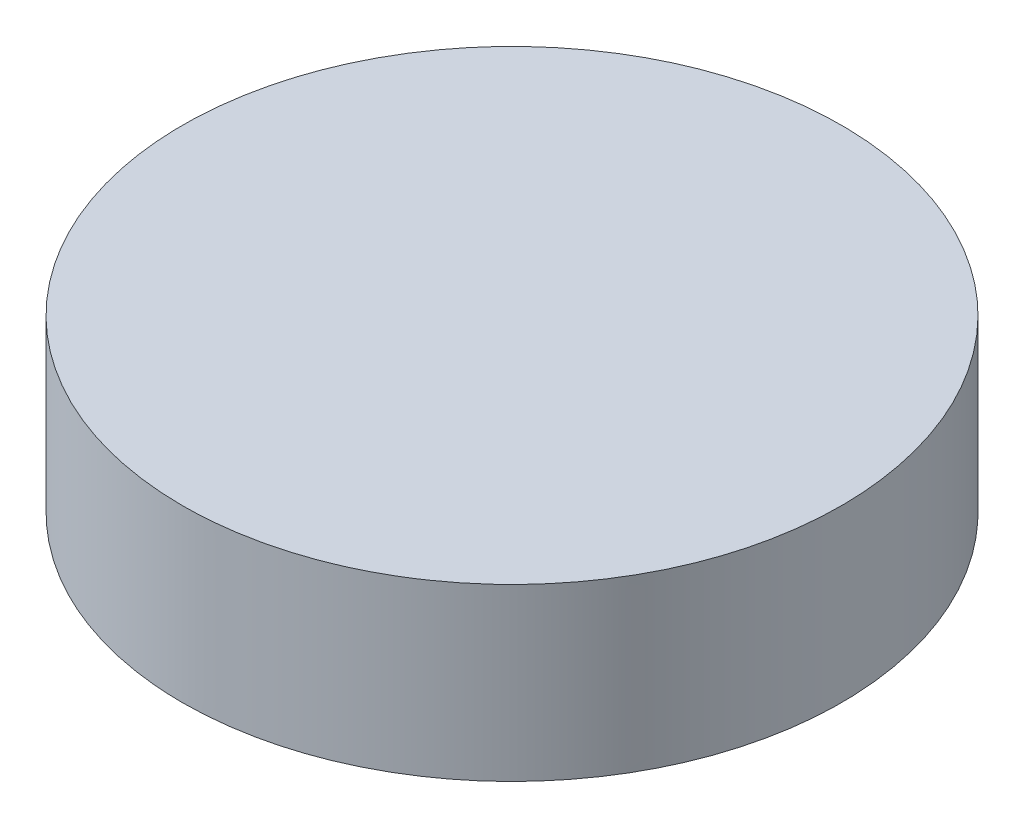
ISO-10303-21;
HEADER;
FILE_DESCRIPTION(('STEP AP214'),'2;1');
FILE_NAME('part.step','',(''),(''),'','','');
FILE_SCHEMA(('AUTOMOTIVE_DESIGN { 1 0 10303 214 1 1 1 1 }'));
ENDSEC;
DATA;
#1=APPLICATION_CONTEXT('core data for automotive mechanical design processes');
#2=APPLICATION_PROTOCOL_DEFINITION('international standard','automotive_design',2000,#1);
#3=PRODUCT_CONTEXT('',#1,'mechanical');
#4=PRODUCT('Part','Part','',(#3));
#5=PRODUCT_RELATED_PRODUCT_CATEGORY('part','',(#4));
#6=PRODUCT_DEFINITION_FORMATION('','',#4);
#7=PRODUCT_DEFINITION_CONTEXT('part definition',#1,'design');
#8=PRODUCT_DEFINITION('design','',#6,#7);
#9=PRODUCT_DEFINITION_SHAPE('','',#8);
#10=(LENGTH_UNIT() NAMED_UNIT(*) SI_UNIT(.MILLI.,.METRE.));
#11=(NAMED_UNIT(*) PLANE_ANGLE_UNIT() SI_UNIT($,.RADIAN.));
#12=(NAMED_UNIT(*) SI_UNIT($,.STERADIAN.) SOLID_ANGLE_UNIT());
#13=UNCERTAINTY_MEASURE_WITH_UNIT(LENGTH_MEASURE(1.E-05),#10,'distance_accuracy_value','');
#14=(GEOMETRIC_REPRESENTATION_CONTEXT(3) GLOBAL_UNCERTAINTY_ASSIGNED_CONTEXT((#13)) GLOBAL_UNIT_ASSIGNED_CONTEXT((#10,
#11,#12)) REPRESENTATION_CONTEXT('',''));
#15=CARTESIAN_POINT('',(0.,0.,0.));
#16=DIRECTION('',(0.,0.,1.));
#17=DIRECTION('',(1.,0.,0.));
#18=AXIS2_PLACEMENT_3D('',#15,#16,#17);
#19=CARTESIAN_POINT('',(-12.5,-11.0166312331574,1.28535533905933));
#20=CARTESIAN_POINT('',(-12.3317700207924,-11.0166312331574,1.28535533905933));
#21=CARTESIAN_POINT('',(-11.9953100623771,-11.0166312331574,1.21842929220248));
#22=CARTESIAN_POINT('',(-11.5674545927316,-11.0166312331574,0.932545407268426));
#23=CARTESIAN_POINT('',(-11.2815707077975,-11.0166312331574,0.504689937622919));
#24=CARTESIAN_POINT('',(-11.1811816375122,-11.0166312331574,0.));
#25=CARTESIAN_POINT('',(-11.2815707077975,-11.0166312331574,-0.504689937622919));
#26=CARTESIAN_POINT('',(-11.5674545927316,-11.0166312331574,-0.932545407268426));
#27=CARTESIAN_POINT('',(-11.9953100623771,-11.0166312331574,-1.21842929220248));
#28=CARTESIAN_POINT('',(-12.5,-11.0166312331574,-1.31881836248775));
#29=CARTESIAN_POINT('',(-13.0046899376229,-11.0166312331574,-1.21842929220248));
#30=CARTESIAN_POINT('',(-13.4325454072684,-11.0166312331574,-0.932545407268426));
#31=CARTESIAN_POINT('',(-13.7184292922025,-11.0166312331574,-0.50468993762292));
#32=CARTESIAN_POINT('',(-13.8188183624877,-11.0166312331574,0.));
#33=CARTESIAN_POINT('',(-13.7184292922025,-11.0166312331574,0.504689937622919));
#34=CARTESIAN_POINT('',(-13.4325454072684,-11.0166312331574,0.932545407268426));
#35=CARTESIAN_POINT('',(-13.0046899376229,-11.0166312331574,1.21842929220248));
#36=CARTESIAN_POINT('',(-12.6682299792076,-11.0166312331574,1.28535533905933));
#37=CARTESIAN_POINT('',(-12.5,-11.0166312331574,1.28535533905933));
#38=B_SPLINE_CURVE_WITH_KNOTS('',3,(#19,#20,#21,#22,#23,#24,#25,#26,#27,#28,#29,#30,#31,#32,#33,
#34,#35,#36,#37),.UNSPECIFIED.,.T.,.F.,(4,1,1,1,1,1,1,1,1,1,1,1,1,1,1,1,4),(0.,
0.0625000000000001,0.125,0.1875,0.25,0.3125,0.375,0.4375,0.5,0.5625,0.625,0.6875,0.75,0.8125,
0.875,0.9375,1.),.UNSPECIFIED.);
#39=DIRECTION('',(0.,1.,0.));
#40=VECTOR('',#39,1.);
#41=SURFACE_OF_LINEAR_EXTRUSION('',#38,#40);
#42=CARTESIAN_POINT('',(-12.5,-11.0166312331574,1.28535533905933));
#43=CARTESIAN_POINT('',(-12.3317700207924,-11.0166312331574,1.28535533905933));
#44=CARTESIAN_POINT('',(-11.9953100623771,-11.0166312331574,1.21842929220248));
#45=CARTESIAN_POINT('',(-11.5674545927316,-11.0166312331574,0.932545407268426));
#46=CARTESIAN_POINT('',(-11.2815707077975,-11.0166312331574,0.504689937622919));
#47=CARTESIAN_POINT('',(-11.1811816375122,-11.0166312331574,0.));
#48=CARTESIAN_POINT('',(-11.2815707077975,-11.0166312331574,-0.504689937622919));
#49=CARTESIAN_POINT('',(-11.5674545927316,-11.0166312331574,-0.932545407268426));
#50=CARTESIAN_POINT('',(-11.9953100623771,-11.0166312331574,-1.21842929220248));
#51=CARTESIAN_POINT('',(-12.5,-11.0166312331574,-1.31881836248775));
#52=CARTESIAN_POINT('',(-13.0046899376229,-11.0166312331574,-1.21842929220248));
#53=CARTESIAN_POINT('',(-13.4325454072684,-11.0166312331574,-0.932545407268426));
#54=CARTESIAN_POINT('',(-13.7184292922025,-11.0166312331574,-0.50468993762292));
#55=CARTESIAN_POINT('',(-13.8188183624877,-11.0166312331574,0.));
#56=CARTESIAN_POINT('',(-13.7184292922025,-11.0166312331574,0.504689937622919));
#57=CARTESIAN_POINT('',(-13.4325454072684,-11.0166312331574,0.932545407268426));
#58=CARTESIAN_POINT('',(-13.0046899376229,-11.0166312331574,1.21842929220248));
#59=CARTESIAN_POINT('',(-12.6682299792076,-11.0166312331574,1.28535533905933));
#60=CARTESIAN_POINT('',(-12.5,-11.0166312331574,1.28535533905933));
#61=B_SPLINE_CURVE_WITH_KNOTS('',3,(#42,#43,#44,#45,#46,#47,#48,#49,#50,#51,#52,#53,#54,#55,#56,
#57,#58,#59,#60),.UNSPECIFIED.,.T.,.F.,(4,1,1,1,1,1,1,1,1,1,1,1,1,1,1,1,4),(0.,
0.0625000000000001,0.125,0.1875,0.25,0.3125,0.375,0.4375,0.5,0.5625,0.625,0.6875,0.75,0.8125,
0.875,0.9375,1.),.UNSPECIFIED.);
#62=CARTESIAN_POINT('',(-12.5,-11.0166312331574,1.28535533905933));
#63=VERTEX_POINT('',#62);
#64=EDGE_CURVE('E9',#63,#63,#61,.T.);
#65=ORIENTED_EDGE('',*,*,#64,.T.);
#66=EDGE_LOOP('',(#65));
#67=FACE_BOUND('',#66,.T.);
#68=CARTESIAN_POINT('',(-12.5,-10.351,1.28535533905933));
#69=CARTESIAN_POINT('',(-12.5210292435893,-10.351,1.28535535428354));
#70=CARTESIAN_POINT('',(-12.5420580506909,-10.351,1.2848324564651));
#71=CARTESIAN_POINT('',(-12.5840656469514,-10.351,1.28275095206051));
#72=CARTESIAN_POINT('',(-12.605044433095,-10.351,1.28119228454248));
#73=CARTESIAN_POINT('',(-12.6469017924796,-10.351,1.27704921828212));
#74=CARTESIAN_POINT('',(-12.6677803587443,-10.351,1.2744647491513));
#75=CARTESIAN_POINT('',(-12.7093873858979,-10.351,1.26828002178174));
#76=CARTESIAN_POINT('',(-12.7301158402734,-10.351,1.26467971973334));
#77=CARTESIAN_POINT('',(-12.7713726611837,-10.351,1.25647322848943));
#78=CARTESIAN_POINT('',(-12.7919010277185,-10.351,1.25186703929392));
#79=CARTESIAN_POINT('',(-12.832707709252,-10.351,1.24165865806837));
#80=CARTESIAN_POINT('',(-12.8529860349978,-10.351,1.23605650900607));
#81=CARTESIAN_POINT('',(-12.8932426430212,-10.351,1.22386610104828));
#82=CARTESIAN_POINT('',(-12.9132209457939,-10.351,1.21727790985115));
#83=CARTESIAN_POINT('',(-12.9528275830444,-10.351,1.20312529881931));
#84=CARTESIAN_POINT('',(-12.9724559380415,-10.351,1.19556093643833));
#85=CARTESIAN_POINT('',(-13.0113124478785,-10.351,1.17946604308371));
#86=CARTESIAN_POINT('',(-13.0305406027184,-10.351,1.17093551211008));
#87=CARTESIAN_POINT('',(-13.06855413176,-10.351,1.15293679752466));
#88=CARTESIAN_POINT('',(-13.0873394798451,-10.351,1.14346855877762));
#89=CARTESIAN_POINT('',(-13.1244251203754,-10.351,1.12362275852903));
#90=CARTESIAN_POINT('',(-13.1427253794428,-10.351,1.11324513466535));
#91=CARTESIAN_POINT('',(-13.1787984767248,-10.351,1.09160886850265));
#92=CARTESIAN_POINT('',(-13.1965712921558,-10.351,1.08035018822159));
#93=CARTESIAN_POINT('',(-13.2315471338735,-10.351,1.05698007794264));
#94=CARTESIAN_POINT('',(-13.2487501601601,-10.351,1.04486864794475));
#95=CARTESIAN_POINT('',(-13.2825440403118,-10.351,1.0198212922901));
#96=CARTESIAN_POINT('',(-13.2991349205488,-10.351,1.00688540221767));
#97=CARTESIAN_POINT('',(-13.331662109414,-10.351,0.980217396939715));
#98=CARTESIAN_POINT('',(-13.3475984628843,-10.351,0.966485336436221));
#99=CARTESIAN_POINT('',(-13.3787742546724,-10.351,0.938253224868504));
#100=CARTESIAN_POINT('',(-13.3940137339342,-10.351,0.923753219032213));
#101=CARTESIAN_POINT('',(-13.4237532190322,-10.351,0.894013733934155));
#102=CARTESIAN_POINT('',(-13.4382532248685,-10.351,0.878774254672389));
#103=CARTESIAN_POINT('',(-13.4664853364362,-10.351,0.847598462884291));
#104=CARTESIAN_POINT('',(-13.4802173969397,-10.351,0.831662109414029));
#105=CARTESIAN_POINT('',(-13.5068854022177,-10.351,0.799134920548772));
#106=CARTESIAN_POINT('',(-13.5198212922901,-10.351,0.782544040311809));
#107=CARTESIAN_POINT('',(-13.5448686479447,-10.351,0.748750160160128));
#108=CARTESIAN_POINT('',(-13.5569800779426,-10.351,0.731547133873459));
#109=CARTESIAN_POINT('',(-13.5803501882216,-10.351,0.696571292155848));
#110=CARTESIAN_POINT('',(-13.5916088685027,-10.351,0.678798476724906));
#111=CARTESIAN_POINT('',(-13.6132451346653,-10.351,0.642725379442669));
#112=CARTESIAN_POINT('',(-13.623622758529,-10.351,0.624425120374889));
#113=CARTESIAN_POINT('',(-13.6434685587776,-10.351,0.587339479845542));
#114=CARTESIAN_POINT('',(-13.6529367975248,-10.351,0.568554131761774));
#115=CARTESIAN_POINT('',(-13.67093551211,-10.351,0.530540602716617));
#116=CARTESIAN_POINT('',(-13.6794660430833,-10.351,0.511312447871825));
#117=CARTESIAN_POINT('',(-13.6955609364387,-10.351,0.472455938048209));
#118=CARTESIAN_POINT('',(-13.7031252988208,-10.351,0.452827583069387));
#119=CARTESIAN_POINT('',(-13.7172779098496,-10.351,0.413220945768882));
#120=CARTESIAN_POINT('',(-13.7238661010426,-10.351,0.39324264292792));
#121=CARTESIAN_POINT('',(-13.7360565090117,-10.351,0.352986035091083));
#122=CARTESIAN_POINT('',(-13.7416586580894,-10.351,0.332707709600189));
#123=CARTESIAN_POINT('',(-13.7518670392729,-10.351,0.291901027370323));
#124=CARTESIAN_POINT('',(-13.7564732284109,-10.351,0.271372659884375));
#125=CARTESIAN_POINT('',(-13.7646797198118,-10.351,0.230115841572818));
#126=CARTESIAN_POINT('',(-13.7682800220747,-10.351,0.209387390747211));
#127=CARTESIAN_POINT('',(-13.7744647488584,-10.351,0.167780353895161));
#128=CARTESIAN_POINT('',(-13.7770492171889,-10.351,0.146901774382847));
#129=CARTESIAN_POINT('',(-13.7811922856357,-10.351,0.10504445119053));
#130=CARTESIAN_POINT('',(-13.7827509561402,-10.351,0.0840657144826372));
#131=CARTESIAN_POINT('',(-13.7848324523857,-10.351,0.0420579831636655));
#132=CARTESIAN_POINT('',(-13.7853553390593,-10.351,0.0210289915818326));
#133=CARTESIAN_POINT('',(-13.7853553390593,-10.351,-0.0210289915818331));
#134=CARTESIAN_POINT('',(-13.7848324523857,-10.351,-0.0420579831636659));
#135=CARTESIAN_POINT('',(-13.7827509561402,-10.351,-0.0840657144826377));
#136=CARTESIAN_POINT('',(-13.7811922856357,-10.351,-0.10504445119053));
#137=CARTESIAN_POINT('',(-13.7770492171889,-10.351,-0.146901774382848));
#138=CARTESIAN_POINT('',(-13.7744647488584,-10.351,-0.167780353895162));
#139=CARTESIAN_POINT('',(-13.7682800220747,-10.351,-0.209387390747211));
#140=CARTESIAN_POINT('',(-13.7646797198118,-10.351,-0.230115841572819));
#141=CARTESIAN_POINT('',(-13.7564732284109,-10.351,-0.271372659884376));
#142=CARTESIAN_POINT('',(-13.7518670392729,-10.351,-0.291901027370324));
#143=CARTESIAN_POINT('',(-13.7416586580894,-10.351,-0.33270770960019));
#144=CARTESIAN_POINT('',(-13.7360565090117,-10.351,-0.352986035091084));
#145=CARTESIAN_POINT('',(-13.7238661010426,-10.351,-0.393242642927921));
#146=CARTESIAN_POINT('',(-13.7172779098496,-10.351,-0.413220945768883));
#147=CARTESIAN_POINT('',(-13.7031252988208,-10.351,-0.452827583069388));
#148=CARTESIAN_POINT('',(-13.6955609364387,-10.351,-0.472455938048211));
#149=CARTESIAN_POINT('',(-13.6794660430833,-10.351,-0.511312447871826));
#150=CARTESIAN_POINT('',(-13.67093551211,-10.351,-0.530540602716618));
#151=CARTESIAN_POINT('',(-13.6529367975248,-10.351,-0.568554131761775));
#152=CARTESIAN_POINT('',(-13.6434685587776,-10.351,-0.587339479845544));
#153=CARTESIAN_POINT('',(-13.623622758529,-10.351,-0.624425120374891));
#154=CARTESIAN_POINT('',(-13.6132451346653,-10.351,-0.64272537944267));
#155=CARTESIAN_POINT('',(-13.5916088685027,-10.351,-0.678798476724906));
#156=CARTESIAN_POINT('',(-13.5803501882216,-10.351,-0.69657129215585));
#157=CARTESIAN_POINT('',(-13.5569800779426,-10.351,-0.731547133873461));
#158=CARTESIAN_POINT('',(-13.5448686479447,-10.351,-0.748750160160129));
#159=CARTESIAN_POINT('',(-13.5198212922901,-10.351,-0.78254404031181));
#160=CARTESIAN_POINT('',(-13.5068854022177,-10.351,-0.799134920548773));
#161=CARTESIAN_POINT('',(-13.4802173969397,-10.351,-0.83166210941403));
#162=CARTESIAN_POINT('',(-13.4664853364362,-10.351,-0.847598462884291));
#163=CARTESIAN_POINT('',(-13.4382532248685,-10.351,-0.87877425467239));
#164=CARTESIAN_POINT('',(-13.4237532190322,-10.351,-0.894013733934156));
#165=CARTESIAN_POINT('',(-13.3940137339342,-10.351,-0.923753219032213));
#166=CARTESIAN_POINT('',(-13.3787742546724,-10.351,-0.938253224868505));
#167=CARTESIAN_POINT('',(-13.3475984628843,-10.351,-0.966485336436221));
#168=CARTESIAN_POINT('',(-13.331662109414,-10.351,-0.980217396939716));
#169=CARTESIAN_POINT('',(-13.2991349205488,-10.351,-1.00688540221767));
#170=CARTESIAN_POINT('',(-13.2825440403118,-10.351,-1.0198212922901));
#171=CARTESIAN_POINT('',(-13.2487501601601,-10.351,-1.04486864794475));
#172=CARTESIAN_POINT('',(-13.2315471338735,-10.351,-1.05698007794264));
#173=CARTESIAN_POINT('',(-13.1965712921558,-10.351,-1.08035018822159));
#174=CARTESIAN_POINT('',(-13.1787984767249,-10.351,-1.09160886850266));
#175=CARTESIAN_POINT('',(-13.1427253794427,-10.351,-1.11324513466535));
#176=CARTESIAN_POINT('',(-13.1244251203749,-10.351,-1.12362275852901));
#177=CARTESIAN_POINT('',(-13.0873394798455,-10.351,-1.14346855877765));
#178=CARTESIAN_POINT('',(-13.0685541317618,-10.351,-1.15293679752477));
#179=CARTESIAN_POINT('',(-13.0305406027166,-10.351,-1.17093551210997));
#180=CARTESIAN_POINT('',(-13.0113124478718,-10.351,-1.17946604308331));
#181=CARTESIAN_POINT('',(-12.9724559380482,-10.351,-1.19556093643873));
#182=CARTESIAN_POINT('',(-12.9528275830694,-10.351,-1.20312529882082));
#183=CARTESIAN_POINT('',(-12.9132209457689,-10.351,-1.21727790984964));
#184=CARTESIAN_POINT('',(-12.8932426429279,-10.351,-1.22386610104265));
#185=CARTESIAN_POINT('',(-12.8529860350911,-10.351,-1.23605650901171));
#186=CARTESIAN_POINT('',(-12.8327077096002,-10.351,-1.24165865808941));
#187=CARTESIAN_POINT('',(-12.7919010273703,-10.351,-1.25186703927288));
#188=CARTESIAN_POINT('',(-12.7713726598844,-10.351,-1.25647322841093));
#189=CARTESIAN_POINT('',(-12.7301158415728,-10.351,-1.26467971981183));
#190=CARTESIAN_POINT('',(-12.7093873907472,-10.351,-1.26828002207469));
#191=CARTESIAN_POINT('',(-12.6677803538952,-10.351,-1.27446474885836));
#192=CARTESIAN_POINT('',(-12.6469017743828,-10.351,-1.27704921718887));
#193=CARTESIAN_POINT('',(-12.6050444511905,-10.351,-1.28119228563567));
#194=CARTESIAN_POINT('',(-12.5840657144826,-10.351,-1.28275095614019));
#195=CARTESIAN_POINT('',(-12.5420579831637,-10.351,-1.28483245238567));
#196=CARTESIAN_POINT('',(-12.5210289915818,-10.351,-1.28535533905933));
#197=CARTESIAN_POINT('',(-12.4789710084182,-10.351,-1.28535533905933));
#198=CARTESIAN_POINT('',(-12.4579420168363,-10.351,-1.28483245238567));
#199=CARTESIAN_POINT('',(-12.4159342855174,-10.351,-1.28275095614019));
#200=CARTESIAN_POINT('',(-12.3949555488095,-10.351,-1.28119228563567));
#201=CARTESIAN_POINT('',(-12.3530982256172,-10.351,-1.27704921718887));
#202=CARTESIAN_POINT('',(-12.3322196461048,-10.351,-1.27446474885836));
#203=CARTESIAN_POINT('',(-12.2906126092528,-10.351,-1.26828002207469));
#204=CARTESIAN_POINT('',(-12.2698841584272,-10.351,-1.26467971981183));
#205=CARTESIAN_POINT('',(-12.2286273401156,-10.351,-1.25647322841093));
#206=CARTESIAN_POINT('',(-12.2080989726297,-10.351,-1.25186703927288));
#207=CARTESIAN_POINT('',(-12.1672922903998,-10.351,-1.24165865808941));
#208=CARTESIAN_POINT('',(-12.1470139649089,-10.351,-1.23605650901171));
#209=CARTESIAN_POINT('',(-12.1067573570721,-10.351,-1.22386610104265));
#210=CARTESIAN_POINT('',(-12.0867790542311,-10.351,-1.21727790984964));
#211=CARTESIAN_POINT('',(-12.0471724169306,-10.351,-1.20312529882082));
#212=CARTESIAN_POINT('',(-12.0275440619518,-10.351,-1.19556093643873));
#213=CARTESIAN_POINT('',(-11.9886875521282,-10.351,-1.17946604308331));
#214=CARTESIAN_POINT('',(-11.9694593972834,-10.351,-1.17093551210997));
#215=CARTESIAN_POINT('',(-11.9314458682382,-10.351,-1.15293679752477));
#216=CARTESIAN_POINT('',(-11.9126605201545,-10.351,-1.14346855877765));
#217=CARTESIAN_POINT('',(-11.8755748796251,-10.351,-1.123622758529));
#218=CARTESIAN_POINT('',(-11.8572746205573,-10.351,-1.11324513466535));
#219=CARTESIAN_POINT('',(-11.8212015232751,-10.351,-1.09160886850266));
#220=CARTESIAN_POINT('',(-11.8034287078441,-10.351,-1.08035018822159));
#221=CARTESIAN_POINT('',(-11.7684528661265,-10.351,-1.05698007794264));
#222=CARTESIAN_POINT('',(-11.7512498398399,-10.351,-1.04486864794475));
#223=CARTESIAN_POINT('',(-11.7174559596882,-10.351,-1.0198212922901));
#224=CARTESIAN_POINT('',(-11.7008650794512,-10.351,-1.00688540221767));
#225=CARTESIAN_POINT('',(-11.668337890586,-10.351,-0.980217396939715));
#226=CARTESIAN_POINT('',(-11.6524015371157,-10.351,-0.966485336436221));
#227=CARTESIAN_POINT('',(-11.6212257453276,-10.351,-0.938253224868504));
#228=CARTESIAN_POINT('',(-11.6059862660658,-10.351,-0.923753219032213));
#229=CARTESIAN_POINT('',(-11.5762467809678,-10.351,-0.894013733934155));
#230=CARTESIAN_POINT('',(-11.5617467751315,-10.351,-0.878774254672389));
#231=CARTESIAN_POINT('',(-11.5335146635638,-10.351,-0.84759846288429));
#232=CARTESIAN_POINT('',(-11.5197826030603,-10.351,-0.831662109414029));
#233=CARTESIAN_POINT('',(-11.4931145977823,-10.351,-0.799134920548772));
#234=CARTESIAN_POINT('',(-11.4801787077099,-10.351,-0.782544040311809));
#235=CARTESIAN_POINT('',(-11.4551313520553,-10.351,-0.748750160160128));
#236=CARTESIAN_POINT('',(-11.4430199220574,-10.351,-0.73154713387346));
#237=CARTESIAN_POINT('',(-11.4196498117784,-10.351,-0.696571292155849));
#238=CARTESIAN_POINT('',(-11.4083911314973,-10.351,-0.678798476724905));
#239=CARTESIAN_POINT('',(-11.3867548653347,-10.351,-0.642725379442669));
#240=CARTESIAN_POINT('',(-11.376377241471,-10.351,-0.62442512037489));
#241=CARTESIAN_POINT('',(-11.3565314412223,-10.351,-0.587339479845543));
#242=CARTESIAN_POINT('',(-11.3470632024752,-10.351,-0.568554131761774));
#243=CARTESIAN_POINT('',(-11.32906448789,-10.351,-0.530540602716617));
#244=CARTESIAN_POINT('',(-11.3205339569167,-10.351,-0.511312447871824));
#245=CARTESIAN_POINT('',(-11.3044390635613,-10.351,-0.472455938048209));
#246=CARTESIAN_POINT('',(-11.2968747011792,-10.351,-0.452827583069387));
#247=CARTESIAN_POINT('',(-11.2827220901504,-10.351,-0.413220945768882));
#248=CARTESIAN_POINT('',(-11.2761338989574,-10.351,-0.39324264292792));
#249=CARTESIAN_POINT('',(-11.2639434909883,-10.351,-0.352986035091083));
#250=CARTESIAN_POINT('',(-11.2583413419106,-10.351,-0.332707709600189));
#251=CARTESIAN_POINT('',(-11.2481329607271,-10.351,-0.291901027370323));
#252=CARTESIAN_POINT('',(-11.2435267715891,-10.351,-0.271372659884375));
#253=CARTESIAN_POINT('',(-11.2353202801882,-10.351,-0.230115841572818));
#254=CARTESIAN_POINT('',(-11.2317199779253,-10.351,-0.209387390747211));
#255=CARTESIAN_POINT('',(-11.2255352511416,-10.351,-0.167780353895161));
#256=CARTESIAN_POINT('',(-11.2229507828111,-10.351,-0.146901774382847));
#257=CARTESIAN_POINT('',(-11.2188077143643,-10.351,-0.105044451190529));
#258=CARTESIAN_POINT('',(-11.2172490438598,-10.351,-0.0840657144826369));
#259=CARTESIAN_POINT('',(-11.2151675476143,-10.351,-0.0420579831636654));
#260=CARTESIAN_POINT('',(-11.2146446609407,-10.351,-0.0210289915818325));
#261=CARTESIAN_POINT('',(-11.2146446609407,-10.351,0.0210289915818333));
#262=CARTESIAN_POINT('',(-11.2151675476143,-10.351,0.0420579831636662));
#263=CARTESIAN_POINT('',(-11.2172490438598,-10.351,0.0840657144826378));
#264=CARTESIAN_POINT('',(-11.2188077143643,-10.351,0.10504445119053));
#265=CARTESIAN_POINT('',(-11.2229507828111,-10.351,0.146901774382848));
#266=CARTESIAN_POINT('',(-11.2255352511416,-10.351,0.167780353895162));
#267=CARTESIAN_POINT('',(-11.2317199779253,-10.351,0.209387390747211));
#268=CARTESIAN_POINT('',(-11.2353202801882,-10.351,0.230115841572819));
#269=CARTESIAN_POINT('',(-11.2435267715891,-10.351,0.271372659884375));
#270=CARTESIAN_POINT('',(-11.2481329607271,-10.351,0.291901027370323));
#271=CARTESIAN_POINT('',(-11.2583413419106,-10.351,0.33270770960019));
#272=CARTESIAN_POINT('',(-11.2639434909883,-10.351,0.352986035091083));
#273=CARTESIAN_POINT('',(-11.2761338989574,-10.351,0.393242642927921));
#274=CARTESIAN_POINT('',(-11.2827220901504,-10.351,0.413220945768883));
#275=CARTESIAN_POINT('',(-11.2968747011792,-10.351,0.452827583069388));
#276=CARTESIAN_POINT('',(-11.3044390635613,-10.351,0.47245593804821));
#277=CARTESIAN_POINT('',(-11.3205339569167,-10.351,0.511312447871825));
#278=CARTESIAN_POINT('',(-11.32906448789,-10.351,0.530540602716618));
#279=CARTESIAN_POINT('',(-11.3470632024752,-10.351,0.568554131761775));
#280=CARTESIAN_POINT('',(-11.3565314412223,-10.351,0.587339479845543));
#281=CARTESIAN_POINT('',(-11.376377241471,-10.351,0.62442512037489));
#282=CARTESIAN_POINT('',(-11.3867548653347,-10.351,0.642725379442669));
#283=CARTESIAN_POINT('',(-11.4083911314973,-10.351,0.678798476724906));
#284=CARTESIAN_POINT('',(-11.4196498117784,-10.351,0.696571292155849));
#285=CARTESIAN_POINT('',(-11.4430199220574,-10.351,0.73154713387346));
#286=CARTESIAN_POINT('',(-11.4551313520553,-10.351,0.748750160160128));
#287=CARTESIAN_POINT('',(-11.4801787077099,-10.351,0.782544040311809));
#288=CARTESIAN_POINT('',(-11.4931145977823,-10.351,0.799134920548772));
#289=CARTESIAN_POINT('',(-11.5197826030603,-10.351,0.831662109414029));
#290=CARTESIAN_POINT('',(-11.5335146635638,-10.351,0.847598462884291));
#291=CARTESIAN_POINT('',(-11.5617467751315,-10.351,0.878774254672389));
#292=CARTESIAN_POINT('',(-11.5762467809678,-10.351,0.894013733934155));
#293=CARTESIAN_POINT('',(-11.6059862660658,-10.351,0.923753219032213));
#294=CARTESIAN_POINT('',(-11.6212257453276,-10.351,0.938253224868505));
#295=CARTESIAN_POINT('',(-11.6524015371157,-10.351,0.966485336436221));
#296=CARTESIAN_POINT('',(-11.668337890586,-10.351,0.980217396939716));
#297=CARTESIAN_POINT('',(-11.7008650794512,-10.351,1.00688540221767));
#298=CARTESIAN_POINT('',(-11.7174559596882,-10.351,1.0198212922901));
#299=CARTESIAN_POINT('',(-11.7512498398399,-10.351,1.04486864794475));
#300=CARTESIAN_POINT('',(-11.7684528661265,-10.351,1.05698007794264));
#301=CARTESIAN_POINT('',(-11.8034287078442,-10.351,1.08035018822159));
#302=CARTESIAN_POINT('',(-11.8212015232752,-10.351,1.09160886850265));
#303=CARTESIAN_POINT('',(-11.8572746205572,-10.351,1.11324513466535));
#304=CARTESIAN_POINT('',(-11.8755748796246,-10.351,1.12362275852903));
#305=CARTESIAN_POINT('',(-11.9126605201549,-10.351,1.14346855877762));
#306=CARTESIAN_POINT('',(-11.93144586824,-10.351,1.15293679752466));
#307=CARTESIAN_POINT('',(-11.9694593972816,-10.351,1.17093551211008));
#308=CARTESIAN_POINT('',(-11.9886875521215,-10.351,1.17946604308371));
#309=CARTESIAN_POINT('',(-12.0275440619585,-10.351,1.19556093643833));
#310=CARTESIAN_POINT('',(-12.0471724169556,-10.351,1.20312529881931));
#311=CARTESIAN_POINT('',(-12.0867790542061,-10.351,1.21727790985115));
#312=CARTESIAN_POINT('',(-12.1067573569788,-10.351,1.22386610104828));
#313=CARTESIAN_POINT('',(-12.1470139650022,-10.351,1.23605650900607));
#314=CARTESIAN_POINT('',(-12.167292290748,-10.351,1.24165865806837));
#315=CARTESIAN_POINT('',(-12.2080989722815,-10.351,1.25186703929392));
#316=CARTESIAN_POINT('',(-12.2286273388163,-10.351,1.25647322848943));
#317=CARTESIAN_POINT('',(-12.2698841597265,-10.351,1.26467971973334));
#318=CARTESIAN_POINT('',(-12.2906126141021,-10.351,1.26828002178174));
#319=CARTESIAN_POINT('',(-12.3322196412557,-10.351,1.2744647491513));
#320=CARTESIAN_POINT('',(-12.3530982075204,-10.351,1.27704921828212));
#321=CARTESIAN_POINT('',(-12.394955566905,-10.351,1.28119228454249));
#322=CARTESIAN_POINT('',(-12.4159343530485,-10.351,1.28275095206051));
#323=CARTESIAN_POINT('',(-12.4579419493091,-10.351,1.2848324564651));
#324=CARTESIAN_POINT('',(-12.4789707564107,-10.351,1.28535535428354));
#325=CARTESIAN_POINT('',(-12.5,-10.351,1.28535533905933));
#326=B_SPLINE_CURVE_WITH_KNOTS('',3,(#68,#69,#70,#71,#72,#73,#74,#75,#76,#77,#78,#79,#80,#81,
#82,#83,#84,#85,#86,#87,#88,#89,#90,#91,#92,#93,#94,#95,#96,#97,#98,#99,#100,#101,#102,#103,
#104,#105,#106,#107,#108,#109,#110,#111,#112,#113,#114,#115,#116,#117,#118,#119,#120,#121,#122,
#123,#124,#125,#126,#127,#128,#129,#130,#131,#132,#133,#134,#135,#136,#137,#138,#139,#140,#141,
#142,#143,#144,#145,#146,#147,#148,#149,#150,#151,#152,#153,#154,#155,#156,#157,#158,#159,#160,
#161,#162,#163,#164,#165,#166,#167,#168,#169,#170,#171,#172,#173,#174,#175,#176,#177,#178,#179,
#180,#181,#182,#183,#184,#185,#186,#187,#188,#189,#190,#191,#192,#193,#194,#195,#196,#197,#198,
#199,#200,#201,#202,#203,#204,#205,#206,#207,#208,#209,#210,#211,#212,#213,#214,#215,#216,#217,
#218,#219,#220,#221,#222,#223,#224,#225,#226,#227,#228,#229,#230,#231,#232,#233,#234,#235,#236,
#237,#238,#239,#240,#241,#242,#243,#244,#245,#246,#247,#248,#249,#250,#251,#252,#253,#254,#255,
#256,#257,#258,#259,#260,#261,#262,#263,#264,#265,#266,#267,#268,#269,#270,#271,#272,#273,#274,
#275,#276,#277,#278,#279,#280,#281,#282,#283,#284,#285,#286,#287,#288,#289,#290,#291,#292,#293,
#294,#295,#296,#297,#298,#299,#300,#301,#302,#303,#304,#305,#306,#307,#308,#309,#310,#311,#312,
#313,#314,#315,#316,#317,#318,#319,#320,#321,#322,#323,#324,#325),.UNSPECIFIED.,.F.,.F.,(4,2,2,
2,2,2,2,2,2,2,2,2,2,2,2,2,2,2,2,2,2,2,2,2,2,2,2,2,2,2,2,2,2,2,2,2,2,2,2,2,2,2,2,2,2,2,2,2,2,2,2,
2,2,2,2,2,2,2,2,2,2,2,2,2,2,2,2,2,2,2,2,2,2,2,2,2,2,2,2,2,2,2,2,2,2,2,2,2,2,2,2,2,2,2,2,2,2,2,2,
2,2,2,2,2,2,2,2,2,2,2,2,2,2,2,2,2,2,2,2,2,2,2,2,2,2,2,2,2,4),(0.,0.0630806127990758,
0.12616493680959,0.189253590290848,0.252344965001654,0.315436339712461,0.378524993193721,
0.441609317204232,0.504689930003312,0.567770542802388,0.6308548668129,0.693943520294158,
0.757034895004962,0.82012626971577,0.883214923197029,0.946299247207541,1.00937986000662,
1.0724604728057,1.13554479681621,1.19863345029747,1.26172482500827,1.32481619971908,
1.38790485320034,1.45098917721085,1.51406979000993,1.57715040280901,1.64023472681952,
1.70332338030078,1.76641475501158,1.82950612972239,1.89259478320365,1.95567910721416,
2.01875972001324,2.08184033281232,2.14492465682283,2.20801331030409,2.27110468501489,
2.3341960597257,2.39728471320696,2.46036903721747,2.52344965001655,2.58653026281563,
2.64961458682614,2.7127032403074,2.7757946150182,2.83888598972901,2.90197464321027,
2.96505896722078,3.02813958001986,3.09122019281893,3.15430451682944,3.2173931703107,
3.28048454502151,3.34357591973231,3.40666457321357,3.46974889722409,3.53282951002316,
3.59591012282224,3.65899444683275,3.72208310031401,3.78517447502482,3.84826584973563,
3.91135450321688,3.9744388272274,4.03751944002647,4.10060005282555,4.16368437683606,
4.22677303031732,4.28986440502813,4.35295577973894,4.4160444332202,4.47912875723071,
4.54220937002979,4.60528998282887,4.66837430683938,4.73146296032063,4.79455433503144,
4.85764570974225,4.9207343632235,4.98381868723402,5.04689930003309,5.10997991283217,
5.17306423684268,5.23615289032394,5.29924426503475,5.36233563974555,5.42542429322681,
5.48850861723732,5.5515892300364,5.61466984283548,5.67775416684599,5.74084282032725,
5.80393419503806,5.86702556974886,5.93011422323012,5.99319854724063,6.05627916003971,
6.11935977283879,6.1824440968493,6.24553275033056,6.30862412504136,6.37171549975217,
6.43480415323343,6.49788847724394,6.56096909004302,6.6240497028421,6.68713402685261,
6.75022268033387,6.81331405504467,6.87640542975548,6.93949408323674,7.00257840724725,
7.06565902004633,7.12873963284541,7.19182395685592,7.25491261033718,7.31800398504799,
7.38109535975879,7.44418401324005,7.50726833725056,7.57034895004964,7.63342956284872,
7.69651388685923,7.75960254034049,7.82269391505129,7.8857852897621,7.94887394324336,
8.01195826725387,8.07503888005295),.UNSPECIFIED.);
#327=CARTESIAN_POINT('',(-12.5,-10.351,1.28535533905933));
#328=VERTEX_POINT('',#327);
#329=EDGE_CURVE('E24',#328,#328,#326,.F.);
#330=ORIENTED_EDGE('',*,*,#329,.F.);
#331=EDGE_LOOP('',(#330));
#332=FACE_BOUND('',#331,.T.);
#333=ADVANCED_FACE('F14',(#67,#332),#41,.T.);
#334=CARTESIAN_POINT('',(-11.25,-11.0166312331574,0.));
#335=DIRECTION('',(0.,1.,0.));
#336=DIRECTION('',(-1.,0.,0.));
#337=AXIS2_PLACEMENT_3D('',#334,#335,#336);
#338=PLANE('',#337);
#339=ORIENTED_EDGE('',*,*,#64,.F.);
#340=EDGE_LOOP('',(#339));
#341=FACE_BOUND('',#340,.T.);
#342=ADVANCED_FACE('F62',(#341),#338,.F.);
#343=CARTESIAN_POINT('',(-11.25,-10.351,0.));
#344=DIRECTION('',(0.,1.,0.));
#345=DIRECTION('',(-1.,0.,0.));
#346=AXIS2_PLACEMENT_3D('',#343,#344,#345);
#347=PLANE('',#346);
#348=ORIENTED_EDGE('',*,*,#329,.T.);
#349=EDGE_LOOP('',(#348));
#350=FACE_BOUND('',#349,.T.);
#351=ADVANCED_FACE('F31',(#350),#347,.T.);
#352=CLOSED_SHELL('',(#333,#342,#351));
#353=MANIFOLD_SOLID_BREP('B1',#352);
#354=ADVANCED_BREP_SHAPE_REPRESENTATION('',(#18,#353),#14);
#355=SHAPE_DEFINITION_REPRESENTATION(#9,#354);
ENDSEC;
END-ISO-10303-21;
